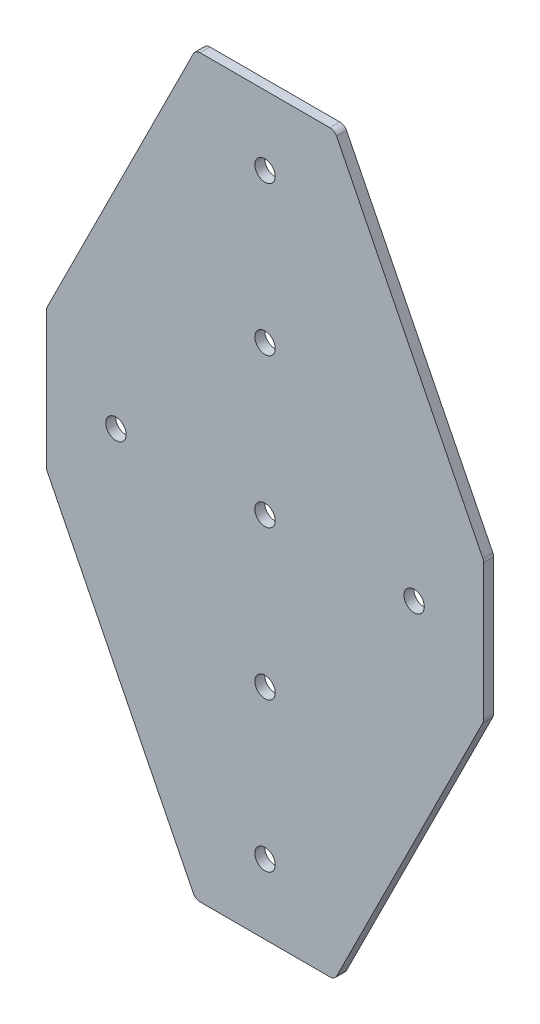
ISO-10303-21;
HEADER;
FILE_DESCRIPTION(('STEP AP214'),'2;1');
FILE_NAME('part.step','',(''),(''),'','','');
FILE_SCHEMA(('AUTOMOTIVE_DESIGN { 1 0 10303 214 1 1 1 1 }'));
ENDSEC;
DATA;
#1=APPLICATION_CONTEXT('core data for automotive mechanical design processes');
#2=APPLICATION_PROTOCOL_DEFINITION('international standard','automotive_design',2000,#1);
#3=PRODUCT_CONTEXT('',#1,'mechanical');
#4=PRODUCT('Part','Part','',(#3));
#5=PRODUCT_RELATED_PRODUCT_CATEGORY('part','',(#4));
#6=PRODUCT_DEFINITION_FORMATION('','',#4);
#7=PRODUCT_DEFINITION_CONTEXT('part definition',#1,'design');
#8=PRODUCT_DEFINITION('design','',#6,#7);
#9=PRODUCT_DEFINITION_SHAPE('','',#8);
#10=(LENGTH_UNIT() NAMED_UNIT(*) SI_UNIT(.MILLI.,.METRE.));
#11=(NAMED_UNIT(*) PLANE_ANGLE_UNIT() SI_UNIT($,.RADIAN.));
#12=(NAMED_UNIT(*) SI_UNIT($,.STERADIAN.) SOLID_ANGLE_UNIT());
#13=UNCERTAINTY_MEASURE_WITH_UNIT(LENGTH_MEASURE(1.E-05),#10,'distance_accuracy_value','');
#14=(GEOMETRIC_REPRESENTATION_CONTEXT(3) GLOBAL_UNCERTAINTY_ASSIGNED_CONTEXT((#13)) GLOBAL_UNIT_ASSIGNED_CONTEXT((#10,
#11,#12)) REPRESENTATION_CONTEXT('',''));
#15=CARTESIAN_POINT('',(0.,0.,0.));
#16=DIRECTION('',(0.,0.,1.));
#17=DIRECTION('',(1.,0.,0.));
#18=AXIS2_PLACEMENT_3D('',#15,#16,#17);
#19=CARTESIAN_POINT('',(148.,28.,4.));
#20=DIRECTION('',(-1.,0.,0.));
#21=DIRECTION('',(0.,0.,1.));
#22=AXIS2_PLACEMENT_3D('',#19,#20,#21);
#23=PLANE('',#22);
#24=DIRECTION('',(0.,1.,0.));
#25=VECTOR('',#24,1.);
#26=CARTESIAN_POINT('',(148.,28.,0.));
#27=LINE('',#26,#25);
#28=CARTESIAN_POINT('',(148.,-27.2917960675007,0.));
#29=VERTEX_POINT('',#28);
#30=CARTESIAN_POINT('',(148.,27.2917960675007,0.));
#31=VERTEX_POINT('',#30);
#32=EDGE_CURVE('E132',#29,#31,#27,.T.);
#33=ORIENTED_EDGE('',*,*,#32,.T.);
#34=DIRECTION('',(0.,0.,-1.));
#35=VECTOR('',#34,1.);
#36=CARTESIAN_POINT('',(148.,27.2917960675007,0.));
#37=LINE('',#36,#35);
#38=CARTESIAN_POINT('',(148.,27.2917960675007,4.));
#39=VERTEX_POINT('',#38);
#40=EDGE_CURVE('E136',#39,#31,#37,.T.);
#41=ORIENTED_EDGE('',*,*,#40,.F.);
#42=DIRECTION('',(0.,1.,0.));
#43=VECTOR('',#42,1.);
#44=CARTESIAN_POINT('',(148.,28.,4.));
#45=LINE('',#44,#43);
#46=CARTESIAN_POINT('',(148.,-27.2917960675007,4.));
#47=VERTEX_POINT('',#46);
#48=EDGE_CURVE('E243',#47,#39,#45,.T.);
#49=ORIENTED_EDGE('',*,*,#48,.F.);
#50=DIRECTION('',(0.,0.,-1.));
#51=VECTOR('',#50,1.);
#52=CARTESIAN_POINT('',(148.,-27.2917960675007,0.));
#53=LINE('',#52,#51);
#54=EDGE_CURVE('E138',#47,#29,#53,.T.);
#55=ORIENTED_EDGE('',*,*,#54,.T.);
#56=EDGE_LOOP('',(#33,#41,#49,#55));
#57=FACE_BOUND('',#56,.T.);
#58=ADVANCED_FACE('F16',(#57),#23,.F.);
#59=CARTESIAN_POINT('',(0.,0.,4.));
#60=DIRECTION('',(0.,0.,1.));
#61=DIRECTION('',(1.,0.,0.));
#62=AXIS2_PLACEMENT_3D('',#59,#60,#61);
#63=PLANE('',#62);
#64=CARTESIAN_POINT('',(60.,0.,4.));
#65=DIRECTION('',(0.,0.,1.));
#66=DIRECTION('',(1.,0.,0.));
#67=AXIS2_PLACEMENT_3D('',#64,#65,#66);
#68=CIRCLE('',#67,4.09999999999999);
#69=CARTESIAN_POINT('',(64.1,0.,4.));
#70=VERTEX_POINT('',#69);
#71=EDGE_CURVE('E228',#70,#70,#68,.T.);
#72=ORIENTED_EDGE('',*,*,#71,.F.);
#73=EDGE_LOOP('',(#72));
#74=FACE_BOUND('',#73,.T.);
#75=CARTESIAN_POINT('',(120.,0.,4.));
#76=DIRECTION('',(0.,0.,1.));
#77=DIRECTION('',(1.,0.,0.));
#78=AXIS2_PLACEMENT_3D('',#75,#76,#77);
#79=CIRCLE('',#78,4.1);
#80=CARTESIAN_POINT('',(124.1,0.,4.));
#81=VERTEX_POINT('',#80);
#82=EDGE_CURVE('E222',#81,#81,#79,.T.);
#83=ORIENTED_EDGE('',*,*,#82,.F.);
#84=EDGE_LOOP('',(#83));
#85=FACE_BOUND('',#84,.T.);
#86=CARTESIAN_POINT('',(0.,0.,4.));
#87=DIRECTION('',(0.,0.,1.));
#88=DIRECTION('',(1.,0.,0.));
#89=AXIS2_PLACEMENT_3D('',#86,#87,#88);
#90=CIRCLE('',#89,4.1);
#91=CARTESIAN_POINT('',(4.1,0.,4.));
#92=VERTEX_POINT('',#91);
#93=EDGE_CURVE('E234',#92,#92,#90,.T.);
#94=ORIENTED_EDGE('',*,*,#93,.F.);
#95=EDGE_LOOP('',(#94));
#96=FACE_BOUND('',#95,.T.);
#97=CARTESIAN_POINT('',(60.0000000000006,-120.,4.));
#98=DIRECTION('',(0.,0.,1.));
#99=DIRECTION('',(1.,0.,0.));
#100=AXIS2_PLACEMENT_3D('',#97,#98,#99);
#101=CIRCLE('',#100,4.09999999999998);
#102=CARTESIAN_POINT('',(64.1000000000006,-120.,4.));
#103=VERTEX_POINT('',#102);
#104=EDGE_CURVE('E216',#103,#103,#101,.T.);
#105=ORIENTED_EDGE('',*,*,#104,.F.);
#106=EDGE_LOOP('',(#105));
#107=FACE_BOUND('',#106,.T.);
#108=CARTESIAN_POINT('',(60.,-60.,4.));
#109=DIRECTION('',(0.,0.,1.));
#110=DIRECTION('',(1.,0.,0.));
#111=AXIS2_PLACEMENT_3D('',#108,#109,#110);
#112=CIRCLE('',#111,4.1);
#113=CARTESIAN_POINT('',(64.1,-60.,4.));
#114=VERTEX_POINT('',#113);
#115=EDGE_CURVE('E210',#114,#114,#112,.T.);
#116=ORIENTED_EDGE('',*,*,#115,.F.);
#117=EDGE_LOOP('',(#116));
#118=FACE_BOUND('',#117,.T.);
#119=ORIENTED_EDGE('',*,*,#48,.T.);
#120=CARTESIAN_POINT('',(145.,27.2917960675007,4.));
#121=DIRECTION('',(0.,0.,-1.));
#122=DIRECTION('',(1.,0.,0.));
#123=AXIS2_PLACEMENT_3D('',#120,#121,#122);
#124=CIRCLE('',#123,3.);
#125=CARTESIAN_POINT('',(147.683281573,28.6334368540006,4.));
#126=VERTEX_POINT('',#125);
#127=EDGE_CURVE('E158',#126,#39,#124,.T.);
#128=ORIENTED_EDGE('',*,*,#127,.F.);
#129=DIRECTION('',(0.447213595499958,-0.894427190999916,0.));
#130=VECTOR('',#129,1.);
#131=CARTESIAN_POINT('',(148.,28.,4.));
#132=LINE('',#131,#130);
#133=CARTESIAN_POINT('',(88.8291796067501,146.3416407865,4.));
#134=VERTEX_POINT('',#133);
#135=EDGE_CURVE('E349',#134,#126,#132,.T.);
#136=ORIENTED_EDGE('',*,*,#135,.F.);
#137=CARTESIAN_POINT('',(86.1458980337503,145.,4.));
#138=DIRECTION('',(0.,0.,-1.));
#139=DIRECTION('',(1.,0.,0.));
#140=AXIS2_PLACEMENT_3D('',#137,#138,#139);
#141=CIRCLE('',#140,3.);
#142=CARTESIAN_POINT('',(86.1458980337503,148.,4.));
#143=VERTEX_POINT('',#142);
#144=EDGE_CURVE('E183',#143,#134,#141,.T.);
#145=ORIENTED_EDGE('',*,*,#144,.F.);
#146=DIRECTION('',(1.,0.,0.));
#147=VECTOR('',#146,1.);
#148=CARTESIAN_POINT('',(32.,148.,4.));
#149=LINE('',#148,#147);
#150=CARTESIAN_POINT('',(33.8541019662497,148.,4.));
#151=VERTEX_POINT('',#150);
#152=EDGE_CURVE('E160',#151,#143,#149,.T.);
#153=ORIENTED_EDGE('',*,*,#152,.F.);
#154=CARTESIAN_POINT('',(33.8541019662497,145.,4.));
#155=DIRECTION('',(0.,0.,-1.));
#156=DIRECTION('',(1.,0.,0.));
#157=AXIS2_PLACEMENT_3D('',#154,#155,#156);
#158=CIRCLE('',#157,3.);
#159=CARTESIAN_POINT('',(31.17082039325,146.3416407865,4.));
#160=VERTEX_POINT('',#159);
#161=EDGE_CURVE('E180',#160,#151,#158,.T.);
#162=ORIENTED_EDGE('',*,*,#161,.F.);
#163=DIRECTION('',(0.447213595499958,0.894427190999916,0.));
#164=VECTOR('',#163,1.);
#165=CARTESIAN_POINT('',(-28.,28.,4.));
#166=LINE('',#165,#164);
#167=CARTESIAN_POINT('',(-27.6832815729997,28.6334368540005,4.));
#168=VERTEX_POINT('',#167);
#169=EDGE_CURVE('E341',#168,#160,#166,.T.);
#170=ORIENTED_EDGE('',*,*,#169,.F.);
#171=CARTESIAN_POINT('',(-25.,27.2917960675006,4.));
#172=DIRECTION('',(0.,0.,-1.));
#173=DIRECTION('',(1.,0.,0.));
#174=AXIS2_PLACEMENT_3D('',#171,#172,#173);
#175=CIRCLE('',#174,3.);
#176=CARTESIAN_POINT('',(-28.,27.2917960675006,4.));
#177=VERTEX_POINT('',#176);
#178=EDGE_CURVE('E177',#177,#168,#175,.T.);
#179=ORIENTED_EDGE('',*,*,#178,.F.);
#180=DIRECTION('',(0.,-1.,0.));
#181=VECTOR('',#180,1.);
#182=CARTESIAN_POINT('',(-28.,28.,4.));
#183=LINE('',#182,#181);
#184=CARTESIAN_POINT('',(-28.,-27.2917960675006,4.));
#185=VERTEX_POINT('',#184);
#186=EDGE_CURVE('E140',#177,#185,#183,.T.);
#187=ORIENTED_EDGE('',*,*,#186,.T.);
#188=CARTESIAN_POINT('',(-25.,-27.2917960675006,4.));
#189=DIRECTION('',(0.,0.,1.));
#190=DIRECTION('',(1.,0.,0.));
#191=AXIS2_PLACEMENT_3D('',#188,#189,#190);
#192=CIRCLE('',#191,3.);
#193=CARTESIAN_POINT('',(-27.6832815729997,-28.6334368540005,4.));
#194=VERTEX_POINT('',#193);
#195=EDGE_CURVE('E262',#185,#194,#192,.T.);
#196=ORIENTED_EDGE('',*,*,#195,.T.);
#197=DIRECTION('',(0.447213595499958,-0.894427190999916,0.));
#198=VECTOR('',#197,1.);
#199=CARTESIAN_POINT('',(-28.,-28.,4.));
#200=LINE('',#199,#198);
#201=CARTESIAN_POINT('',(31.17082039325,-146.3416407865,4.));
#202=VERTEX_POINT('',#201);
#203=EDGE_CURVE('E204',#194,#202,#200,.T.);
#204=ORIENTED_EDGE('',*,*,#203,.T.);
#205=CARTESIAN_POINT('',(33.8541019662497,-145.,4.));
#206=DIRECTION('',(0.,0.,1.));
#207=DIRECTION('',(1.,0.,0.));
#208=AXIS2_PLACEMENT_3D('',#205,#206,#207);
#209=CIRCLE('',#208,3.);
#210=CARTESIAN_POINT('',(33.8541019662497,-148.,4.));
#211=VERTEX_POINT('',#210);
#212=EDGE_CURVE('E38',#202,#211,#209,.T.);
#213=ORIENTED_EDGE('',*,*,#212,.T.);
#214=DIRECTION('',(1.,0.,0.));
#215=VECTOR('',#214,1.);
#216=CARTESIAN_POINT('',(32.,-148.,4.));
#217=LINE('',#216,#215);
#218=CARTESIAN_POINT('',(86.1458980337503,-148.,4.));
#219=VERTEX_POINT('',#218);
#220=EDGE_CURVE('E241',#211,#219,#217,.T.);
#221=ORIENTED_EDGE('',*,*,#220,.T.);
#222=CARTESIAN_POINT('',(86.1458980337503,-145.,4.));
#223=DIRECTION('',(0.,0.,1.));
#224=DIRECTION('',(1.,0.,0.));
#225=AXIS2_PLACEMENT_3D('',#222,#223,#224);
#226=CIRCLE('',#225,3.);
#227=CARTESIAN_POINT('',(88.8291796067501,-146.3416407865,4.));
#228=VERTEX_POINT('',#227);
#229=EDGE_CURVE('E265',#219,#228,#226,.T.);
#230=ORIENTED_EDGE('',*,*,#229,.T.);
#231=DIRECTION('',(0.447213595499958,0.894427190999916,0.));
#232=VECTOR('',#231,1.);
#233=CARTESIAN_POINT('',(148.,-28.,4.));
#234=LINE('',#233,#232);
#235=CARTESIAN_POINT('',(147.683281573,-28.6334368540006,4.));
#236=VERTEX_POINT('',#235);
#237=EDGE_CURVE('E198',#228,#236,#234,.T.);
#238=ORIENTED_EDGE('',*,*,#237,.T.);
#239=CARTESIAN_POINT('',(145.,-27.2917960675007,4.));
#240=DIRECTION('',(0.,0.,1.));
#241=DIRECTION('',(1.,0.,0.));
#242=AXIS2_PLACEMENT_3D('',#239,#240,#241);
#243=CIRCLE('',#242,3.);
#244=EDGE_CURVE('E267',#236,#47,#243,.T.);
#245=ORIENTED_EDGE('',*,*,#244,.T.);
#246=EDGE_LOOP('',(#119,#128,#136,#145,#153,#162,#170,#179,#187,#196,#204,#213,#221,#230,#238,#245));
#247=FACE_BOUND('',#246,.T.);
#248=CARTESIAN_POINT('',(60.0000000000006,120.,4.));
#249=DIRECTION('',(0.,0.,-1.));
#250=DIRECTION('',(1.,0.,0.));
#251=AXIS2_PLACEMENT_3D('',#248,#249,#250);
#252=CIRCLE('',#251,4.09999999999998);
#253=CARTESIAN_POINT('',(64.1000000000006,120.,4.));
#254=VERTEX_POINT('',#253);
#255=EDGE_CURVE('E359',#254,#254,#252,.T.);
#256=ORIENTED_EDGE('',*,*,#255,.T.);
#257=EDGE_LOOP('',(#256));
#258=FACE_BOUND('',#257,.T.);
#259=CARTESIAN_POINT('',(60.,60.,4.));
#260=DIRECTION('',(0.,0.,-1.));
#261=DIRECTION('',(1.,0.,0.));
#262=AXIS2_PLACEMENT_3D('',#259,#260,#261);
#263=CIRCLE('',#262,4.1);
#264=CARTESIAN_POINT('',(64.1,60.,4.));
#265=VERTEX_POINT('',#264);
#266=EDGE_CURVE('E353',#265,#265,#263,.T.);
#267=ORIENTED_EDGE('',*,*,#266,.T.);
#268=EDGE_LOOP('',(#267));
#269=FACE_BOUND('',#268,.T.);
#270=ADVANCED_FACE('F282',(#74,#85,#96,#107,#118,#247,#258,#269),#63,.T.);
#271=CARTESIAN_POINT('',(0.,0.,0.));
#272=DIRECTION('',(0.,0.,1.));
#273=DIRECTION('',(1.,0.,0.));
#274=AXIS2_PLACEMENT_3D('',#271,#272,#273);
#275=PLANE('',#274);
#276=CARTESIAN_POINT('',(60.,0.,0.));
#277=DIRECTION('',(0.,0.,1.));
#278=DIRECTION('',(1.,0.,0.));
#279=AXIS2_PLACEMENT_3D('',#276,#277,#278);
#280=CIRCLE('',#279,4.09999999999999);
#281=CARTESIAN_POINT('',(64.1,0.,0.));
#282=VERTEX_POINT('',#281);
#283=EDGE_CURVE('E225',#282,#282,#280,.T.);
#284=ORIENTED_EDGE('',*,*,#283,.T.);
#285=EDGE_LOOP('',(#284));
#286=FACE_BOUND('',#285,.T.);
#287=CARTESIAN_POINT('',(120.,0.,0.));
#288=DIRECTION('',(0.,0.,1.));
#289=DIRECTION('',(1.,0.,0.));
#290=AXIS2_PLACEMENT_3D('',#287,#288,#289);
#291=CIRCLE('',#290,4.1);
#292=CARTESIAN_POINT('',(124.1,0.,0.));
#293=VERTEX_POINT('',#292);
#294=EDGE_CURVE('E219',#293,#293,#291,.T.);
#295=ORIENTED_EDGE('',*,*,#294,.T.);
#296=EDGE_LOOP('',(#295));
#297=FACE_BOUND('',#296,.T.);
#298=CARTESIAN_POINT('',(0.,0.,0.));
#299=DIRECTION('',(0.,0.,1.));
#300=DIRECTION('',(1.,0.,0.));
#301=AXIS2_PLACEMENT_3D('',#298,#299,#300);
#302=CIRCLE('',#301,4.1);
#303=CARTESIAN_POINT('',(4.1,0.,0.));
#304=VERTEX_POINT('',#303);
#305=EDGE_CURVE('E231',#304,#304,#302,.T.);
#306=ORIENTED_EDGE('',*,*,#305,.T.);
#307=EDGE_LOOP('',(#306));
#308=FACE_BOUND('',#307,.T.);
#309=CARTESIAN_POINT('',(60.,-60.,0.));
#310=DIRECTION('',(0.,0.,1.));
#311=DIRECTION('',(1.,0.,0.));
#312=AXIS2_PLACEMENT_3D('',#309,#310,#311);
#313=CIRCLE('',#312,4.1);
#314=CARTESIAN_POINT('',(64.1,-60.,0.));
#315=VERTEX_POINT('',#314);
#316=EDGE_CURVE('E209',#315,#315,#313,.T.);
#317=ORIENTED_EDGE('',*,*,#316,.T.);
#318=EDGE_LOOP('',(#317));
#319=FACE_BOUND('',#318,.T.);
#320=CARTESIAN_POINT('',(60.0000000000006,-120.,0.));
#321=DIRECTION('',(0.,0.,1.));
#322=DIRECTION('',(1.,0.,0.));
#323=AXIS2_PLACEMENT_3D('',#320,#321,#322);
#324=CIRCLE('',#323,4.09999999999998);
#325=CARTESIAN_POINT('',(64.1000000000006,-120.,0.));
#326=VERTEX_POINT('',#325);
#327=EDGE_CURVE('E213',#326,#326,#324,.T.);
#328=ORIENTED_EDGE('',*,*,#327,.T.);
#329=EDGE_LOOP('',(#328));
#330=FACE_BOUND('',#329,.T.);
#331=CARTESIAN_POINT('',(145.,27.2917960675007,0.));
#332=DIRECTION('',(0.,0.,-1.));
#333=DIRECTION('',(1.,0.,0.));
#334=AXIS2_PLACEMENT_3D('',#331,#332,#333);
#335=CIRCLE('',#334,3.);
#336=CARTESIAN_POINT('',(147.683281573,28.6334368540006,0.));
#337=VERTEX_POINT('',#336);
#338=EDGE_CURVE('E145',#31,#337,#335,.F.);
#339=ORIENTED_EDGE('',*,*,#338,.F.);
#340=ORIENTED_EDGE('',*,*,#32,.F.);
#341=CARTESIAN_POINT('',(145.,-27.2917960675007,0.));
#342=DIRECTION('',(0.,0.,1.));
#343=DIRECTION('',(1.,0.,0.));
#344=AXIS2_PLACEMENT_3D('',#341,#342,#343);
#345=CIRCLE('',#344,3.);
#346=CARTESIAN_POINT('',(147.683281573,-28.6334368540006,0.));
#347=VERTEX_POINT('',#346);
#348=EDGE_CURVE('E255',#29,#347,#345,.F.);
#349=ORIENTED_EDGE('',*,*,#348,.T.);
#350=DIRECTION('',(-0.447213595499958,-0.894427190999916,0.));
#351=VECTOR('',#350,1.);
#352=CARTESIAN_POINT('',(148.,-28.,0.));
#353=LINE('',#352,#351);
#354=CARTESIAN_POINT('',(88.82917960675,-146.3416407865,0.));
#355=VERTEX_POINT('',#354);
#356=EDGE_CURVE('E201',#347,#355,#353,.T.);
#357=ORIENTED_EDGE('',*,*,#356,.T.);
#358=CARTESIAN_POINT('',(86.1458980337503,-145.,0.));
#359=DIRECTION('',(0.,0.,1.));
#360=DIRECTION('',(1.,0.,0.));
#361=AXIS2_PLACEMENT_3D('',#358,#359,#360);
#362=CIRCLE('',#361,3.);
#363=CARTESIAN_POINT('',(86.1458980337503,-148.,0.));
#364=VERTEX_POINT('',#363);
#365=EDGE_CURVE('E253',#355,#364,#362,.F.);
#366=ORIENTED_EDGE('',*,*,#365,.T.);
#367=DIRECTION('',(1.,0.,0.));
#368=VECTOR('',#367,1.);
#369=CARTESIAN_POINT('',(32.,-148.,0.));
#370=LINE('',#369,#368);
#371=CARTESIAN_POINT('',(33.8541019662497,-148.,0.));
#372=VERTEX_POINT('',#371);
#373=EDGE_CURVE('E141',#372,#364,#370,.T.);
#374=ORIENTED_EDGE('',*,*,#373,.F.);
#375=CARTESIAN_POINT('',(33.8541019662497,-145.,0.));
#376=DIRECTION('',(0.,0.,1.));
#377=DIRECTION('',(1.,0.,0.));
#378=AXIS2_PLACEMENT_3D('',#375,#376,#377);
#379=CIRCLE('',#378,3.);
#380=CARTESIAN_POINT('',(31.17082039325,-146.3416407865,0.));
#381=VERTEX_POINT('',#380);
#382=EDGE_CURVE('E251',#372,#381,#379,.F.);
#383=ORIENTED_EDGE('',*,*,#382,.T.);
#384=DIRECTION('',(-0.447213595499958,0.894427190999916,0.));
#385=VECTOR('',#384,1.);
#386=CARTESIAN_POINT('',(-28.,-28.,0.));
#387=LINE('',#386,#385);
#388=CARTESIAN_POINT('',(-27.6832815729997,-28.6334368540005,0.));
#389=VERTEX_POINT('',#388);
#390=EDGE_CURVE('E206',#381,#389,#387,.T.);
#391=ORIENTED_EDGE('',*,*,#390,.T.);
#392=CARTESIAN_POINT('',(-25.,-27.2917960675006,0.));
#393=DIRECTION('',(0.,0.,1.));
#394=DIRECTION('',(1.,0.,0.));
#395=AXIS2_PLACEMENT_3D('',#392,#393,#394);
#396=CIRCLE('',#395,3.);
#397=CARTESIAN_POINT('',(-28.,-27.2917960675006,0.));
#398=VERTEX_POINT('',#397);
#399=EDGE_CURVE('E248',#389,#398,#396,.F.);
#400=ORIENTED_EDGE('',*,*,#399,.T.);
#401=DIRECTION('',(0.,-1.,0.));
#402=VECTOR('',#401,1.);
#403=CARTESIAN_POINT('',(-28.,28.,0.));
#404=LINE('',#403,#402);
#405=CARTESIAN_POINT('',(-28.,27.2917960675006,0.));
#406=VERTEX_POINT('',#405);
#407=EDGE_CURVE('E237',#406,#398,#404,.T.);
#408=ORIENTED_EDGE('',*,*,#407,.F.);
#409=CARTESIAN_POINT('',(-25.,27.2917960675006,0.));
#410=DIRECTION('',(0.,0.,-1.));
#411=DIRECTION('',(1.,0.,0.));
#412=AXIS2_PLACEMENT_3D('',#409,#410,#411);
#413=CIRCLE('',#412,3.);
#414=CARTESIAN_POINT('',(-27.6832815729997,28.6334368540005,0.));
#415=VERTEX_POINT('',#414);
#416=EDGE_CURVE('E159',#415,#406,#413,.F.);
#417=ORIENTED_EDGE('',*,*,#416,.F.);
#418=DIRECTION('',(-0.447213595499958,-0.894427190999916,0.));
#419=VECTOR('',#418,1.);
#420=CARTESIAN_POINT('',(-28.,28.,0.));
#421=LINE('',#420,#419);
#422=CARTESIAN_POINT('',(31.17082039325,146.3416407865,0.));
#423=VERTEX_POINT('',#422);
#424=EDGE_CURVE('E344',#423,#415,#421,.T.);
#425=ORIENTED_EDGE('',*,*,#424,.F.);
#426=CARTESIAN_POINT('',(33.8541019662497,145.,0.));
#427=DIRECTION('',(0.,0.,-1.));
#428=DIRECTION('',(1.,0.,0.));
#429=AXIS2_PLACEMENT_3D('',#426,#427,#428);
#430=CIRCLE('',#429,3.);
#431=CARTESIAN_POINT('',(33.8541019662497,148.,0.));
#432=VERTEX_POINT('',#431);
#433=EDGE_CURVE('E163',#432,#423,#430,.F.);
#434=ORIENTED_EDGE('',*,*,#433,.F.);
#435=DIRECTION('',(1.,0.,0.));
#436=VECTOR('',#435,1.);
#437=CARTESIAN_POINT('',(32.,148.,0.));
#438=LINE('',#437,#436);
#439=CARTESIAN_POINT('',(86.1458980337503,148.,0.));
#440=VERTEX_POINT('',#439);
#441=EDGE_CURVE('E166',#432,#440,#438,.T.);
#442=ORIENTED_EDGE('',*,*,#441,.T.);
#443=CARTESIAN_POINT('',(86.1458980337503,145.,0.));
#444=DIRECTION('',(0.,0.,-1.));
#445=DIRECTION('',(1.,0.,0.));
#446=AXIS2_PLACEMENT_3D('',#443,#444,#445);
#447=CIRCLE('',#446,3.);
#448=CARTESIAN_POINT('',(88.82917960675,146.3416407865,0.));
#449=VERTEX_POINT('',#448);
#450=EDGE_CURVE('E153',#449,#440,#447,.F.);
#451=ORIENTED_EDGE('',*,*,#450,.F.);
#452=DIRECTION('',(-0.447213595499958,0.894427190999916,0.));
#453=VECTOR('',#452,1.);
#454=CARTESIAN_POINT('',(148.,28.,0.));
#455=LINE('',#454,#453);
#456=EDGE_CURVE('E150',#337,#449,#455,.T.);
#457=ORIENTED_EDGE('',*,*,#456,.F.);
#458=EDGE_LOOP('',(#339,#340,#349,#357,#366,#374,#383,#391,#400,#408,#417,#425,#434,#442,#451,#457));
#459=FACE_BOUND('',#458,.T.);
#460=CARTESIAN_POINT('',(60.,60.,0.));
#461=DIRECTION('',(0.,0.,-1.));
#462=DIRECTION('',(1.,0.,0.));
#463=AXIS2_PLACEMENT_3D('',#460,#461,#462);
#464=CIRCLE('',#463,4.1);
#465=CARTESIAN_POINT('',(64.1,60.,0.));
#466=VERTEX_POINT('',#465);
#467=EDGE_CURVE('E347',#466,#466,#464,.T.);
#468=ORIENTED_EDGE('',*,*,#467,.F.);
#469=EDGE_LOOP('',(#468));
#470=FACE_BOUND('',#469,.T.);
#471=CARTESIAN_POINT('',(60.0000000000006,120.,0.));
#472=DIRECTION('',(0.,0.,-1.));
#473=DIRECTION('',(1.,0.,0.));
#474=AXIS2_PLACEMENT_3D('',#471,#472,#473);
#475=CIRCLE('',#474,4.09999999999998);
#476=CARTESIAN_POINT('',(64.1000000000006,120.,0.));
#477=VERTEX_POINT('',#476);
#478=EDGE_CURVE('E356',#477,#477,#475,.T.);
#479=ORIENTED_EDGE('',*,*,#478,.F.);
#480=EDGE_LOOP('',(#479));
#481=FACE_BOUND('',#480,.T.);
#482=ADVANCED_FACE('F146',(#286,#297,#308,#319,#330,#459,#470,#481),#275,.F.);
#483=CARTESIAN_POINT('',(0.,0.,4.));
#484=DIRECTION('',(0.,0.,-1.));
#485=DIRECTION('',(-1.,0.,0.));
#486=AXIS2_PLACEMENT_3D('',#483,#484,#485);
#487=CYLINDRICAL_SURFACE('',#486,4.1);
#488=ORIENTED_EDGE('',*,*,#305,.F.);
#489=EDGE_LOOP('',(#488));
#490=FACE_BOUND('',#489,.T.);
#491=ORIENTED_EDGE('',*,*,#93,.T.);
#492=EDGE_LOOP('',(#491));
#493=FACE_BOUND('',#492,.T.);
#494=ADVANCED_FACE('F368',(#490,#493),#487,.F.);
#495=CARTESIAN_POINT('',(60.,0.,4.));
#496=DIRECTION('',(0.,0.,-1.));
#497=DIRECTION('',(-1.,0.,0.));
#498=AXIS2_PLACEMENT_3D('',#495,#496,#497);
#499=CYLINDRICAL_SURFACE('',#498,4.09999999999999);
#500=ORIENTED_EDGE('',*,*,#283,.F.);
#501=EDGE_LOOP('',(#500));
#502=FACE_BOUND('',#501,.T.);
#503=ORIENTED_EDGE('',*,*,#71,.T.);
#504=EDGE_LOOP('',(#503));
#505=FACE_BOUND('',#504,.T.);
#506=ADVANCED_FACE('F329',(#502,#505),#499,.F.);
#507=CARTESIAN_POINT('',(120.,0.,4.));
#508=DIRECTION('',(0.,0.,-1.));
#509=DIRECTION('',(-1.,0.,0.));
#510=AXIS2_PLACEMENT_3D('',#507,#508,#509);
#511=CYLINDRICAL_SURFACE('',#510,4.1);
#512=ORIENTED_EDGE('',*,*,#82,.T.);
#513=EDGE_LOOP('',(#512));
#514=FACE_BOUND('',#513,.T.);
#515=ORIENTED_EDGE('',*,*,#294,.F.);
#516=EDGE_LOOP('',(#515));
#517=FACE_BOUND('',#516,.T.);
#518=ADVANCED_FACE('F324',(#514,#517),#511,.F.);
#519=CARTESIAN_POINT('',(-28.,28.,4.));
#520=DIRECTION('',(1.,0.,0.));
#521=DIRECTION('',(0.,1.,0.));
#522=AXIS2_PLACEMENT_3D('',#519,#520,#521);
#523=PLANE('',#522);
#524=ORIENTED_EDGE('',*,*,#186,.F.);
#525=DIRECTION('',(0.,0.,-1.));
#526=VECTOR('',#525,1.);
#527=CARTESIAN_POINT('',(-28.,27.2917960675006,4.));
#528=LINE('',#527,#526);
#529=EDGE_CURVE('E195',#406,#177,#528,.F.);
#530=ORIENTED_EDGE('',*,*,#529,.F.);
#531=ORIENTED_EDGE('',*,*,#407,.T.);
#532=DIRECTION('',(0.,0.,-1.));
#533=VECTOR('',#532,1.);
#534=CARTESIAN_POINT('',(-28.,-27.2917960675006,4.));
#535=LINE('',#534,#533);
#536=EDGE_CURVE('E10',#398,#185,#535,.F.);
#537=ORIENTED_EDGE('',*,*,#536,.T.);
#538=EDGE_LOOP('',(#524,#530,#531,#537));
#539=FACE_BOUND('',#538,.T.);
#540=ADVANCED_FACE('F322',(#539),#523,.F.);
#541=CARTESIAN_POINT('',(32.,-148.,4.));
#542=DIRECTION('',(0.,1.,0.));
#543=DIRECTION('',(0.,0.,1.));
#544=AXIS2_PLACEMENT_3D('',#541,#542,#543);
#545=PLANE('',#544);
#546=ORIENTED_EDGE('',*,*,#373,.T.);
#547=DIRECTION('',(0.,0.,-1.));
#548=VECTOR('',#547,1.);
#549=CARTESIAN_POINT('',(86.1458980337503,-148.,4.));
#550=LINE('',#549,#548);
#551=EDGE_CURVE('E31',#364,#219,#550,.F.);
#552=ORIENTED_EDGE('',*,*,#551,.T.);
#553=ORIENTED_EDGE('',*,*,#220,.F.);
#554=DIRECTION('',(0.,0.,-1.));
#555=VECTOR('',#554,1.);
#556=CARTESIAN_POINT('',(33.8541019662497,-148.,0.));
#557=LINE('',#556,#555);
#558=EDGE_CURVE('E269',#211,#372,#557,.T.);
#559=ORIENTED_EDGE('',*,*,#558,.T.);
#560=EDGE_LOOP('',(#546,#552,#553,#559));
#561=FACE_BOUND('',#560,.T.);
#562=ADVANCED_FACE('F288',(#561),#545,.F.);
#563=CARTESIAN_POINT('',(60.0000000000006,-120.,4.));
#564=DIRECTION('',(0.,0.,-1.));
#565=DIRECTION('',(-1.,0.,0.));
#566=AXIS2_PLACEMENT_3D('',#563,#564,#565);
#567=CYLINDRICAL_SURFACE('',#566,4.09999999999998);
#568=ORIENTED_EDGE('',*,*,#104,.T.);
#569=EDGE_LOOP('',(#568));
#570=FACE_BOUND('',#569,.T.);
#571=ORIENTED_EDGE('',*,*,#327,.F.);
#572=EDGE_LOOP('',(#571));
#573=FACE_BOUND('',#572,.T.);
#574=ADVANCED_FACE('F321',(#570,#573),#567,.F.);
#575=CARTESIAN_POINT('',(60.,-60.,4.));
#576=DIRECTION('',(0.,0.,-1.));
#577=DIRECTION('',(-1.,0.,0.));
#578=AXIS2_PLACEMENT_3D('',#575,#576,#577);
#579=CYLINDRICAL_SURFACE('',#578,4.1);
#580=ORIENTED_EDGE('',*,*,#115,.T.);
#581=EDGE_LOOP('',(#580));
#582=FACE_BOUND('',#581,.T.);
#583=ORIENTED_EDGE('',*,*,#316,.F.);
#584=EDGE_LOOP('',(#583));
#585=FACE_BOUND('',#584,.T.);
#586=ADVANCED_FACE('F386',(#582,#585),#579,.F.);
#587=CARTESIAN_POINT('',(-28.,-28.,-134.164078649987));
#588=DIRECTION('',(-0.894427190999916,-0.447213595499958,0.));
#589=DIRECTION('',(0.447213595499958,-0.894427190999916,0.));
#590=AXIS2_PLACEMENT_3D('',#587,#588,#589);
#591=PLANE('',#590);
#592=ORIENTED_EDGE('',*,*,#390,.F.);
#593=DIRECTION('',(0.,0.,-1.));
#594=VECTOR('',#593,1.);
#595=CARTESIAN_POINT('',(31.17082039325,-146.3416407865,4.));
#596=LINE('',#595,#594);
#597=EDGE_CURVE('E24',#381,#202,#596,.F.);
#598=ORIENTED_EDGE('',*,*,#597,.T.);
#599=ORIENTED_EDGE('',*,*,#203,.F.);
#600=DIRECTION('',(0.,0.,-1.));
#601=VECTOR('',#600,1.);
#602=CARTESIAN_POINT('',(-27.6832815729997,-28.6334368540005,0.));
#603=LINE('',#602,#601);
#604=EDGE_CURVE('E273',#194,#389,#603,.T.);
#605=ORIENTED_EDGE('',*,*,#604,.T.);
#606=EDGE_LOOP('',(#592,#598,#599,#605));
#607=FACE_BOUND('',#606,.T.);
#608=ADVANCED_FACE('F279',(#607),#591,.T.);
#609=CARTESIAN_POINT('',(148.,-28.,-134.164078649987));
#610=DIRECTION('',(0.894427190999916,-0.447213595499958,0.));
#611=DIRECTION('',(0.447213595499958,0.894427190999916,0.));
#612=AXIS2_PLACEMENT_3D('',#609,#610,#611);
#613=PLANE('',#612);
#614=ORIENTED_EDGE('',*,*,#356,.F.);
#615=DIRECTION('',(0.,0.,-1.));
#616=VECTOR('',#615,1.);
#617=CARTESIAN_POINT('',(147.683281573,-28.6334368540006,4.));
#618=LINE('',#617,#616);
#619=EDGE_CURVE('E260',#347,#236,#618,.F.);
#620=ORIENTED_EDGE('',*,*,#619,.T.);
#621=ORIENTED_EDGE('',*,*,#237,.F.);
#622=DIRECTION('',(0.,0.,-1.));
#623=VECTOR('',#622,1.);
#624=CARTESIAN_POINT('',(88.8291796067501,-146.3416407865,0.));
#625=LINE('',#624,#623);
#626=EDGE_CURVE('E257',#228,#355,#625,.T.);
#627=ORIENTED_EDGE('',*,*,#626,.T.);
#628=EDGE_LOOP('',(#614,#620,#621,#627));
#629=FACE_BOUND('',#628,.T.);
#630=ADVANCED_FACE('F296',(#629),#613,.T.);
#631=CARTESIAN_POINT('',(145.,-27.2917960675007,4.));
#632=DIRECTION('',(0.,0.,1.));
#633=DIRECTION('',(1.,0.,0.));
#634=AXIS2_PLACEMENT_3D('',#631,#632,#633);
#635=CYLINDRICAL_SURFACE('',#634,3.);
#636=ORIENTED_EDGE('',*,*,#244,.F.);
#637=ORIENTED_EDGE('',*,*,#619,.F.);
#638=ORIENTED_EDGE('',*,*,#348,.F.);
#639=ORIENTED_EDGE('',*,*,#54,.F.);
#640=EDGE_LOOP('',(#636,#637,#638,#639));
#641=FACE_BOUND('',#640,.T.);
#642=ADVANCED_FACE('F300',(#641),#635,.T.);
#643=CARTESIAN_POINT('',(86.1458980337503,-145.,-134.164078649987));
#644=DIRECTION('',(0.,0.,1.));
#645=DIRECTION('',(1.,0.,0.));
#646=AXIS2_PLACEMENT_3D('',#643,#644,#645);
#647=CYLINDRICAL_SURFACE('',#646,3.);
#648=ORIENTED_EDGE('',*,*,#229,.F.);
#649=ORIENTED_EDGE('',*,*,#551,.F.);
#650=ORIENTED_EDGE('',*,*,#365,.F.);
#651=ORIENTED_EDGE('',*,*,#626,.F.);
#652=EDGE_LOOP('',(#648,#649,#650,#651));
#653=FACE_BOUND('',#652,.T.);
#654=ADVANCED_FACE('F293',(#653),#647,.T.);
#655=CARTESIAN_POINT('',(33.8541019662497,-145.,4.));
#656=DIRECTION('',(0.,0.,1.));
#657=DIRECTION('',(1.,0.,0.));
#658=AXIS2_PLACEMENT_3D('',#655,#656,#657);
#659=CYLINDRICAL_SURFACE('',#658,3.);
#660=ORIENTED_EDGE('',*,*,#212,.F.);
#661=ORIENTED_EDGE('',*,*,#597,.F.);
#662=ORIENTED_EDGE('',*,*,#382,.F.);
#663=ORIENTED_EDGE('',*,*,#558,.F.);
#664=EDGE_LOOP('',(#660,#661,#662,#663));
#665=FACE_BOUND('',#664,.T.);
#666=ADVANCED_FACE('F286',(#665),#659,.T.);
#667=CARTESIAN_POINT('',(-25.,-27.2917960675006,-134.164078649987));
#668=DIRECTION('',(0.,0.,1.));
#669=DIRECTION('',(1.,0.,0.));
#670=AXIS2_PLACEMENT_3D('',#667,#668,#669);
#671=CYLINDRICAL_SURFACE('',#670,3.);
#672=ORIENTED_EDGE('',*,*,#195,.F.);
#673=ORIENTED_EDGE('',*,*,#536,.F.);
#674=ORIENTED_EDGE('',*,*,#399,.F.);
#675=ORIENTED_EDGE('',*,*,#604,.F.);
#676=EDGE_LOOP('',(#672,#673,#674,#675));
#677=FACE_BOUND('',#676,.T.);
#678=ADVANCED_FACE('F18',(#677),#671,.T.);
#679=CARTESIAN_POINT('',(32.,148.,4.));
#680=DIRECTION('',(0.,-1.,0.));
#681=DIRECTION('',(0.,0.,1.));
#682=AXIS2_PLACEMENT_3D('',#679,#680,#681);
#683=PLANE('',#682);
#684=ORIENTED_EDGE('',*,*,#441,.F.);
#685=DIRECTION('',(0.,0.,-1.));
#686=VECTOR('',#685,1.);
#687=CARTESIAN_POINT('',(33.8541019662497,148.,0.));
#688=LINE('',#687,#686);
#689=EDGE_CURVE('E187',#151,#432,#688,.T.);
#690=ORIENTED_EDGE('',*,*,#689,.F.);
#691=ORIENTED_EDGE('',*,*,#152,.T.);
#692=DIRECTION('',(0.,0.,-1.));
#693=VECTOR('',#692,1.);
#694=CARTESIAN_POINT('',(86.1458980337503,148.,4.));
#695=LINE('',#694,#693);
#696=EDGE_CURVE('E189',#440,#143,#695,.F.);
#697=ORIENTED_EDGE('',*,*,#696,.F.);
#698=EDGE_LOOP('',(#684,#690,#691,#697));
#699=FACE_BOUND('',#698,.T.);
#700=ADVANCED_FACE('F489',(#699),#683,.F.);
#701=CARTESIAN_POINT('',(60.0000000000006,120.,4.));
#702=DIRECTION('',(0.,0.,-1.));
#703=DIRECTION('',(-1.,0.,0.));
#704=AXIS2_PLACEMENT_3D('',#701,#702,#703);
#705=CYLINDRICAL_SURFACE('',#704,4.09999999999998);
#706=ORIENTED_EDGE('',*,*,#255,.F.);
#707=EDGE_LOOP('',(#706));
#708=FACE_BOUND('',#707,.T.);
#709=ORIENTED_EDGE('',*,*,#478,.T.);
#710=EDGE_LOOP('',(#709));
#711=FACE_BOUND('',#710,.T.);
#712=ADVANCED_FACE('F365',(#708,#711),#705,.F.);
#713=CARTESIAN_POINT('',(60.,60.,4.));
#714=DIRECTION('',(0.,0.,-1.));
#715=DIRECTION('',(-1.,0.,0.));
#716=AXIS2_PLACEMENT_3D('',#713,#714,#715);
#717=CYLINDRICAL_SURFACE('',#716,4.1);
#718=ORIENTED_EDGE('',*,*,#266,.F.);
#719=EDGE_LOOP('',(#718));
#720=FACE_BOUND('',#719,.T.);
#721=ORIENTED_EDGE('',*,*,#467,.T.);
#722=EDGE_LOOP('',(#721));
#723=FACE_BOUND('',#722,.T.);
#724=ADVANCED_FACE('F507',(#720,#723),#717,.F.);
#725=CARTESIAN_POINT('',(-28.,28.,-134.164078649987));
#726=DIRECTION('',(-0.894427190999916,0.447213595499958,0.));
#727=DIRECTION('',(0.447213595499958,0.894427190999916,0.));
#728=AXIS2_PLACEMENT_3D('',#725,#726,#727);
#729=PLANE('',#728);
#730=ORIENTED_EDGE('',*,*,#424,.T.);
#731=DIRECTION('',(0.,0.,-1.));
#732=VECTOR('',#731,1.);
#733=CARTESIAN_POINT('',(-27.6832815729997,28.6334368540005,0.));
#734=LINE('',#733,#732);
#735=EDGE_CURVE('E191',#168,#415,#734,.T.);
#736=ORIENTED_EDGE('',*,*,#735,.F.);
#737=ORIENTED_EDGE('',*,*,#169,.T.);
#738=DIRECTION('',(0.,0.,-1.));
#739=VECTOR('',#738,1.);
#740=CARTESIAN_POINT('',(31.17082039325,146.3416407865,4.));
#741=LINE('',#740,#739);
#742=EDGE_CURVE('E193',#423,#160,#741,.F.);
#743=ORIENTED_EDGE('',*,*,#742,.F.);
#744=EDGE_LOOP('',(#730,#736,#737,#743));
#745=FACE_BOUND('',#744,.T.);
#746=ADVANCED_FACE('F517',(#745),#729,.T.);
#747=CARTESIAN_POINT('',(148.,28.,-134.164078649987));
#748=DIRECTION('',(0.894427190999916,0.447213595499958,0.));
#749=DIRECTION('',(0.447213595499958,-0.894427190999916,0.));
#750=AXIS2_PLACEMENT_3D('',#747,#748,#749);
#751=PLANE('',#750);
#752=ORIENTED_EDGE('',*,*,#456,.T.);
#753=DIRECTION('',(0.,0.,-1.));
#754=VECTOR('',#753,1.);
#755=CARTESIAN_POINT('',(88.8291796067501,146.3416407865,0.));
#756=LINE('',#755,#754);
#757=EDGE_CURVE('E152',#134,#449,#756,.T.);
#758=ORIENTED_EDGE('',*,*,#757,.F.);
#759=ORIENTED_EDGE('',*,*,#135,.T.);
#760=DIRECTION('',(0.,0.,-1.));
#761=VECTOR('',#760,1.);
#762=CARTESIAN_POINT('',(147.683281573,28.6334368540006,4.));
#763=LINE('',#762,#761);
#764=EDGE_CURVE('E175',#337,#126,#763,.F.);
#765=ORIENTED_EDGE('',*,*,#764,.F.);
#766=EDGE_LOOP('',(#752,#758,#759,#765));
#767=FACE_BOUND('',#766,.T.);
#768=ADVANCED_FACE('F527',(#767),#751,.T.);
#769=CARTESIAN_POINT('',(145.,27.2917960675007,4.));
#770=DIRECTION('',(0.,0.,1.));
#771=DIRECTION('',(1.,0.,0.));
#772=AXIS2_PLACEMENT_3D('',#769,#770,#771);
#773=CYLINDRICAL_SURFACE('',#772,3.);
#774=ORIENTED_EDGE('',*,*,#127,.T.);
#775=ORIENTED_EDGE('',*,*,#40,.T.);
#776=ORIENTED_EDGE('',*,*,#338,.T.);
#777=ORIENTED_EDGE('',*,*,#764,.T.);
#778=EDGE_LOOP('',(#774,#775,#776,#777));
#779=FACE_BOUND('',#778,.T.);
#780=ADVANCED_FACE('F156',(#779),#773,.T.);
#781=CARTESIAN_POINT('',(86.1458980337503,145.,-134.164078649987));
#782=DIRECTION('',(0.,0.,1.));
#783=DIRECTION('',(1.,0.,0.));
#784=AXIS2_PLACEMENT_3D('',#781,#782,#783);
#785=CYLINDRICAL_SURFACE('',#784,3.);
#786=ORIENTED_EDGE('',*,*,#144,.T.);
#787=ORIENTED_EDGE('',*,*,#757,.T.);
#788=ORIENTED_EDGE('',*,*,#450,.T.);
#789=ORIENTED_EDGE('',*,*,#696,.T.);
#790=EDGE_LOOP('',(#786,#787,#788,#789));
#791=FACE_BOUND('',#790,.T.);
#792=ADVANCED_FACE('F545',(#791),#785,.T.);
#793=CARTESIAN_POINT('',(33.8541019662497,145.,4.));
#794=DIRECTION('',(0.,0.,1.));
#795=DIRECTION('',(1.,0.,0.));
#796=AXIS2_PLACEMENT_3D('',#793,#794,#795);
#797=CYLINDRICAL_SURFACE('',#796,3.);
#798=ORIENTED_EDGE('',*,*,#161,.T.);
#799=ORIENTED_EDGE('',*,*,#689,.T.);
#800=ORIENTED_EDGE('',*,*,#433,.T.);
#801=ORIENTED_EDGE('',*,*,#742,.T.);
#802=EDGE_LOOP('',(#798,#799,#800,#801));
#803=FACE_BOUND('',#802,.T.);
#804=ADVANCED_FACE('F554',(#803),#797,.T.);
#805=CARTESIAN_POINT('',(-25.,27.2917960675006,-134.164078649987));
#806=DIRECTION('',(0.,0.,1.));
#807=DIRECTION('',(1.,0.,0.));
#808=AXIS2_PLACEMENT_3D('',#805,#806,#807);
#809=CYLINDRICAL_SURFACE('',#808,3.);
#810=ORIENTED_EDGE('',*,*,#178,.T.);
#811=ORIENTED_EDGE('',*,*,#735,.T.);
#812=ORIENTED_EDGE('',*,*,#416,.T.);
#813=ORIENTED_EDGE('',*,*,#529,.T.);
#814=EDGE_LOOP('',(#810,#811,#812,#813));
#815=FACE_BOUND('',#814,.T.);
#816=ADVANCED_FACE('F336',(#815),#809,.T.);
#817=CLOSED_SHELL('',(#58,#270,#482,#494,#506,#518,#540,#562,#574,#586,#608,#630,#642,#654,#666,
#678,#700,#712,#724,#746,#768,#780,#792,#804,#816));
#818=MANIFOLD_SOLID_BREP('B1',#817);
#819=ADVANCED_BREP_SHAPE_REPRESENTATION('',(#18,#818),#14);
#820=SHAPE_DEFINITION_REPRESENTATION(#9,#819);
ENDSEC;
END-ISO-10303-21;
